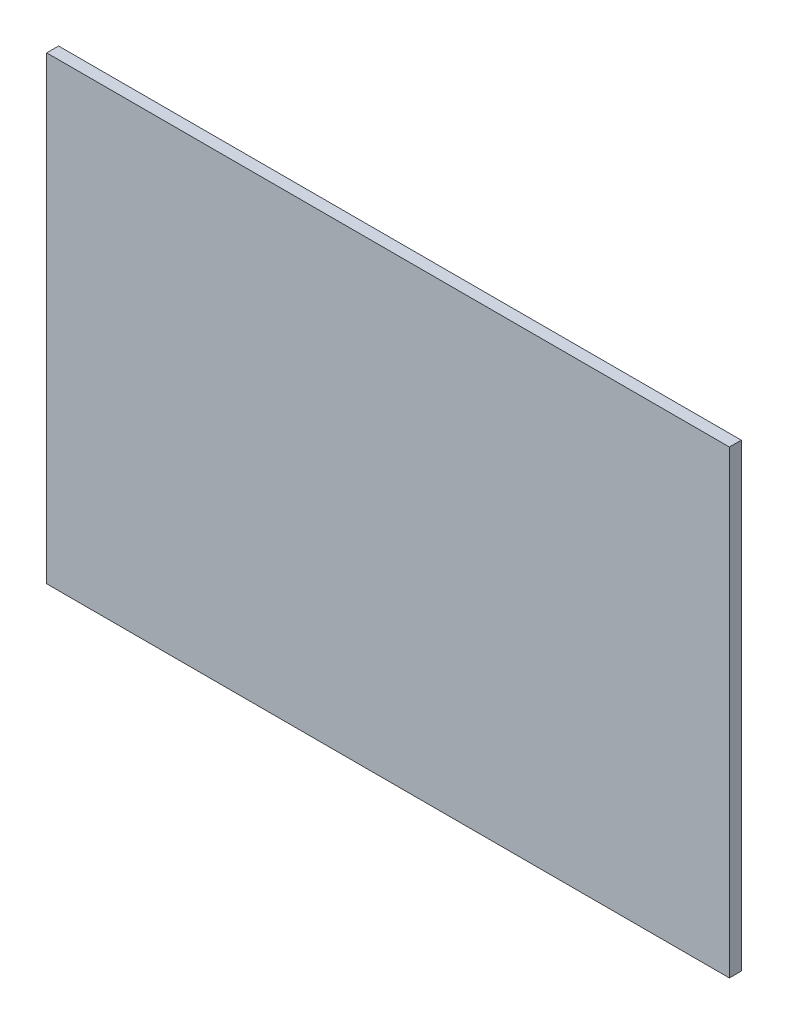
ISO-10303-21;
HEADER;
FILE_DESCRIPTION(('STEP AP214'),'2;1');
FILE_NAME('part.step','',(''),(''),'','','');
FILE_SCHEMA(('AUTOMOTIVE_DESIGN { 1 0 10303 214 1 1 1 1 }'));
ENDSEC;
DATA;
#1=APPLICATION_CONTEXT('core data for automotive mechanical design processes');
#2=APPLICATION_PROTOCOL_DEFINITION('international standard','automotive_design',2000,#1);
#3=PRODUCT_CONTEXT('',#1,'mechanical');
#4=PRODUCT('Part','Part','',(#3));
#5=PRODUCT_RELATED_PRODUCT_CATEGORY('part','',(#4));
#6=PRODUCT_DEFINITION_FORMATION('','',#4);
#7=PRODUCT_DEFINITION_CONTEXT('part definition',#1,'design');
#8=PRODUCT_DEFINITION('design','',#6,#7);
#9=PRODUCT_DEFINITION_SHAPE('','',#8);
#10=(LENGTH_UNIT() NAMED_UNIT(*) SI_UNIT(.MILLI.,.METRE.));
#11=(NAMED_UNIT(*) PLANE_ANGLE_UNIT() SI_UNIT($,.RADIAN.));
#12=(NAMED_UNIT(*) SI_UNIT($,.STERADIAN.) SOLID_ANGLE_UNIT());
#13=UNCERTAINTY_MEASURE_WITH_UNIT(LENGTH_MEASURE(1.E-05),#10,'distance_accuracy_value','');
#14=(GEOMETRIC_REPRESENTATION_CONTEXT(3) GLOBAL_UNCERTAINTY_ASSIGNED_CONTEXT((#13)) GLOBAL_UNIT_ASSIGNED_CONTEXT((#10,
#11,#12)) REPRESENTATION_CONTEXT('',''));
#15=CARTESIAN_POINT('',(0.,0.,0.));
#16=DIRECTION('',(0.,0.,1.));
#17=DIRECTION('',(1.,0.,0.));
#18=AXIS2_PLACEMENT_3D('',#15,#16,#17);
#19=CARTESIAN_POINT('',(-66.4703073978217,30.576231861744,2.54));
#20=DIRECTION('',(1.,0.,0.));
#21=DIRECTION('',(0.,0.,-1.));
#22=AXIS2_PLACEMENT_3D('',#19,#20,#21);
#23=PLANE('',#22);
#24=DIRECTION('',(0.,-1.,0.));
#25=VECTOR('',#24,1.);
#26=CARTESIAN_POINT('',(-66.4703073978217,30.576231861744,0.));
#27=LINE('',#26,#25);
#28=CARTESIAN_POINT('',(-66.4703073978217,30.576231861744,0.));
#29=VERTEX_POINT('',#28);
#30=CARTESIAN_POINT('',(-66.4703073978217,-67.6616516518038,0.));
#31=VERTEX_POINT('',#30);
#32=EDGE_CURVE('E96',#29,#31,#27,.T.);
#33=ORIENTED_EDGE('',*,*,#32,.T.);
#34=DIRECTION('',(0.,0.,-1.));
#35=VECTOR('',#34,1.);
#36=CARTESIAN_POINT('',(-66.4703073978217,-67.6616516518038,2.54));
#37=LINE('',#36,#35);
#38=CARTESIAN_POINT('',(-66.4703073978217,-67.6616516518038,2.54));
#39=VERTEX_POINT('',#38);
#40=EDGE_CURVE('E11',#39,#31,#37,.T.);
#41=ORIENTED_EDGE('',*,*,#40,.F.);
#42=DIRECTION('',(0.,-1.,0.));
#43=VECTOR('',#42,1.);
#44=CARTESIAN_POINT('',(-66.4703073978217,30.576231861744,2.54));
#45=LINE('',#44,#43);
#46=CARTESIAN_POINT('',(-66.4703073978217,30.576231861744,2.54));
#47=VERTEX_POINT('',#46);
#48=EDGE_CURVE('E84',#47,#39,#45,.T.);
#49=ORIENTED_EDGE('',*,*,#48,.F.);
#50=DIRECTION('',(0.,0.,-1.));
#51=VECTOR('',#50,1.);
#52=CARTESIAN_POINT('',(-66.4703073978217,30.576231861744,2.54));
#53=LINE('',#52,#51);
#54=EDGE_CURVE('E92',#47,#29,#53,.T.);
#55=ORIENTED_EDGE('',*,*,#54,.T.);
#56=EDGE_LOOP('',(#33,#41,#49,#55));
#57=FACE_BOUND('',#56,.T.);
#58=ADVANCED_FACE('F33',(#57),#23,.F.);
#59=CARTESIAN_POINT('',(-66.4703073978217,-67.6616516518038,2.54));
#60=DIRECTION('',(0.,1.,0.));
#61=DIRECTION('',(0.,0.,1.));
#62=AXIS2_PLACEMENT_3D('',#59,#60,#61);
#63=PLANE('',#62);
#64=DIRECTION('',(1.,0.,0.));
#65=VECTOR('',#64,1.);
#66=CARTESIAN_POINT('',(-66.4703073978217,-67.6616516518038,0.));
#67=LINE('',#66,#65);
#68=CARTESIAN_POINT('',(79.377230682951,-67.6616516518038,0.));
#69=VERTEX_POINT('',#68);
#70=EDGE_CURVE('E88',#31,#69,#67,.T.);
#71=ORIENTED_EDGE('',*,*,#70,.T.);
#72=DIRECTION('',(0.,0.,-1.));
#73=VECTOR('',#72,1.);
#74=CARTESIAN_POINT('',(79.377230682951,-67.6616516518038,2.54));
#75=LINE('',#74,#73);
#76=CARTESIAN_POINT('',(79.377230682951,-67.6616516518038,2.54));
#77=VERTEX_POINT('',#76);
#78=EDGE_CURVE('E41',#77,#69,#75,.T.);
#79=ORIENTED_EDGE('',*,*,#78,.F.);
#80=DIRECTION('',(1.,0.,0.));
#81=VECTOR('',#80,1.);
#82=CARTESIAN_POINT('',(-66.4703073978217,-67.6616516518038,2.54));
#83=LINE('',#82,#81);
#84=EDGE_CURVE('E79',#39,#77,#83,.T.);
#85=ORIENTED_EDGE('',*,*,#84,.F.);
#86=ORIENTED_EDGE('',*,*,#40,.T.);
#87=EDGE_LOOP('',(#71,#79,#85,#86));
#88=FACE_BOUND('',#87,.T.);
#89=ADVANCED_FACE('F87',(#88),#63,.F.);
#90=CARTESIAN_POINT('',(79.377230682951,30.576231861744,2.54));
#91=DIRECTION('',(-1.,0.,0.));
#92=DIRECTION('',(0.,0.,1.));
#93=AXIS2_PLACEMENT_3D('',#90,#91,#92);
#94=PLANE('',#93);
#95=DIRECTION('',(0.,1.,0.));
#96=VECTOR('',#95,1.);
#97=CARTESIAN_POINT('',(79.377230682951,30.576231861744,0.));
#98=LINE('',#97,#96);
#99=CARTESIAN_POINT('',(79.377230682951,30.576231861744,0.));
#100=VERTEX_POINT('',#99);
#101=EDGE_CURVE('E66',#69,#100,#98,.T.);
#102=ORIENTED_EDGE('',*,*,#101,.T.);
#103=DIRECTION('',(0.,0.,-1.));
#104=VECTOR('',#103,1.);
#105=CARTESIAN_POINT('',(79.377230682951,30.576231861744,2.54));
#106=LINE('',#105,#104);
#107=CARTESIAN_POINT('',(79.377230682951,30.576231861744,2.54));
#108=VERTEX_POINT('',#107);
#109=EDGE_CURVE('E89',#108,#100,#106,.T.);
#110=ORIENTED_EDGE('',*,*,#109,.F.);
#111=DIRECTION('',(0.,1.,0.));
#112=VECTOR('',#111,1.);
#113=CARTESIAN_POINT('',(79.377230682951,30.576231861744,2.54));
#114=LINE('',#113,#112);
#115=EDGE_CURVE('E82',#77,#108,#114,.T.);
#116=ORIENTED_EDGE('',*,*,#115,.F.);
#117=ORIENTED_EDGE('',*,*,#78,.T.);
#118=EDGE_LOOP('',(#102,#110,#116,#117));
#119=FACE_BOUND('',#118,.T.);
#120=ADVANCED_FACE('F90',(#119),#94,.F.);
#121=CARTESIAN_POINT('',(-66.4703073978217,30.576231861744,2.54));
#122=DIRECTION('',(0.,-1.,0.));
#123=DIRECTION('',(0.,0.,-1.));
#124=AXIS2_PLACEMENT_3D('',#121,#122,#123);
#125=PLANE('',#124);
#126=DIRECTION('',(-1.,0.,0.));
#127=VECTOR('',#126,1.);
#128=CARTESIAN_POINT('',(-66.4703073978217,30.576231861744,0.));
#129=LINE('',#128,#127);
#130=EDGE_CURVE('E72',#100,#29,#129,.T.);
#131=ORIENTED_EDGE('',*,*,#130,.T.);
#132=ORIENTED_EDGE('',*,*,#54,.F.);
#133=DIRECTION('',(-1.,0.,0.));
#134=VECTOR('',#133,1.);
#135=CARTESIAN_POINT('',(-66.4703073978217,30.576231861744,2.54));
#136=LINE('',#135,#134);
#137=EDGE_CURVE('E49',#108,#47,#136,.T.);
#138=ORIENTED_EDGE('',*,*,#137,.F.);
#139=ORIENTED_EDGE('',*,*,#109,.T.);
#140=EDGE_LOOP('',(#131,#132,#138,#139));
#141=FACE_BOUND('',#140,.T.);
#142=ADVANCED_FACE('F103',(#141),#125,.F.);
#143=CARTESIAN_POINT('',(0.,0.,2.54));
#144=DIRECTION('',(0.,0.,1.));
#145=DIRECTION('',(1.,0.,0.));
#146=AXIS2_PLACEMENT_3D('',#143,#144,#145);
#147=PLANE('',#146);
#148=ORIENTED_EDGE('',*,*,#48,.T.);
#149=ORIENTED_EDGE('',*,*,#84,.T.);
#150=ORIENTED_EDGE('',*,*,#115,.T.);
#151=ORIENTED_EDGE('',*,*,#137,.T.);
#152=EDGE_LOOP('',(#148,#149,#150,#151));
#153=FACE_BOUND('',#152,.T.);
#154=ADVANCED_FACE('F80',(#153),#147,.T.);
#155=CARTESIAN_POINT('',(0.,0.,0.));
#156=DIRECTION('',(0.,0.,1.));
#157=DIRECTION('',(1.,0.,0.));
#158=AXIS2_PLACEMENT_3D('',#155,#156,#157);
#159=PLANE('',#158);
#160=ORIENTED_EDGE('',*,*,#32,.F.);
#161=ORIENTED_EDGE('',*,*,#130,.F.);
#162=ORIENTED_EDGE('',*,*,#101,.F.);
#163=ORIENTED_EDGE('',*,*,#70,.F.);
#164=EDGE_LOOP('',(#160,#161,#162,#163));
#165=FACE_BOUND('',#164,.T.);
#166=ADVANCED_FACE('F106',(#165),#159,.F.);
#167=CLOSED_SHELL('',(#58,#89,#120,#142,#154,#166));
#168=MANIFOLD_SOLID_BREP('B2',#167);
#169=ADVANCED_BREP_SHAPE_REPRESENTATION('',(#18,#168),#14);
#170=SHAPE_DEFINITION_REPRESENTATION(#9,#169);
ENDSEC;
END-ISO-10303-21;
